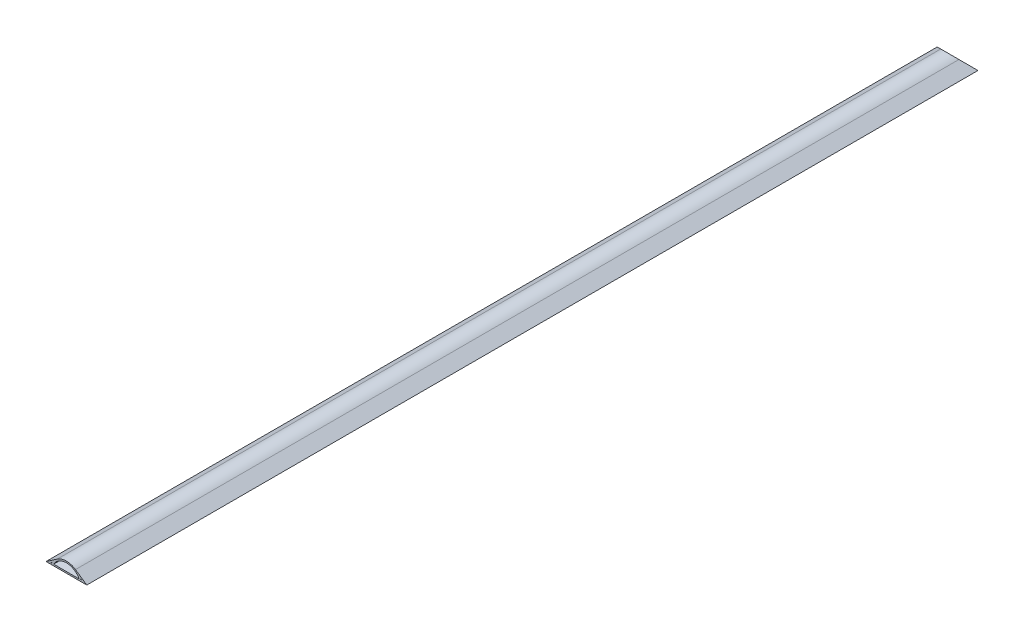
ISO-10303-21;
HEADER;
FILE_DESCRIPTION(('STEP AP214'),'2;1');
FILE_NAME('part.step','',(''),(''),'','','');
FILE_SCHEMA(('AUTOMOTIVE_DESIGN { 1 0 10303 214 1 1 1 1 }'));
ENDSEC;
DATA;
#1=APPLICATION_CONTEXT('core data for automotive mechanical design processes');
#2=APPLICATION_PROTOCOL_DEFINITION('international standard','automotive_design',2000,#1);
#3=PRODUCT_CONTEXT('',#1,'mechanical');
#4=PRODUCT('Part','Part','',(#3));
#5=PRODUCT_RELATED_PRODUCT_CATEGORY('part','',(#4));
#6=PRODUCT_DEFINITION_FORMATION('','',#4);
#7=PRODUCT_DEFINITION_CONTEXT('part definition',#1,'design');
#8=PRODUCT_DEFINITION('design','',#6,#7);
#9=PRODUCT_DEFINITION_SHAPE('','',#8);
#10=(LENGTH_UNIT() NAMED_UNIT(*) SI_UNIT(.MILLI.,.METRE.));
#11=(NAMED_UNIT(*) PLANE_ANGLE_UNIT() SI_UNIT($,.RADIAN.));
#12=(NAMED_UNIT(*) SI_UNIT($,.STERADIAN.) SOLID_ANGLE_UNIT());
#13=UNCERTAINTY_MEASURE_WITH_UNIT(LENGTH_MEASURE(1.E-05),#10,'distance_accuracy_value','');
#14=(GEOMETRIC_REPRESENTATION_CONTEXT(3) GLOBAL_UNCERTAINTY_ASSIGNED_CONTEXT((#13)) GLOBAL_UNIT_ASSIGNED_CONTEXT((#10,
#11,#12)) REPRESENTATION_CONTEXT('',''));
#15=CARTESIAN_POINT('',(0.,0.,0.));
#16=DIRECTION('',(0.,0.,1.));
#17=DIRECTION('',(1.,0.,0.));
#18=AXIS2_PLACEMENT_3D('',#15,#16,#17);
#19=CARTESIAN_POINT('',(34.29,-9.25285714285715,1498.6));
#20=DIRECTION('',(0.,0.,-1.));
#21=DIRECTION('',(-1.,0.,0.));
#22=AXIS2_PLACEMENT_3D('',#19,#20,#21);
#23=CYLINDRICAL_SURFACE('',#22,27.0328571428572);
#24=CARTESIAN_POINT('',(34.29,-9.25285714285715,-9.25285714285695));
#25=DIRECTION('',(0.,0.707106781186544,-0.707106781186551));
#26=DIRECTION('',(0.,-0.707106781186551,-0.707106781186544));
#27=AXIS2_PLACEMENT_3D('',#24,#25,#26);
#28=ELLIPSE('',#27,38.2302332011228,27.0328571428572);
#29=CARTESIAN_POINT('',(18.9926798567758,13.0354214300123,13.0354214300124));
#30=VERTEX_POINT('',#29);
#31=CARTESIAN_POINT('',(49.5873201432243,13.0354214300122,13.0354214300127));
#32=VERTEX_POINT('',#31);
#33=EDGE_CURVE('E48',#30,#32,#28,.T.);
#34=ORIENTED_EDGE('',*,*,#33,.F.);
#35=DIRECTION('',(0.,0.,-1.));
#36=VECTOR('',#35,1.);
#37=CARTESIAN_POINT('',(18.9926798567758,13.0354214300123,1498.6));
#38=LINE('',#37,#36);
#39=CARTESIAN_POINT('',(18.9926798567758,13.0354214300123,1498.6));
#40=VERTEX_POINT('',#39);
#41=EDGE_CURVE('E41',#40,#30,#38,.T.);
#42=ORIENTED_EDGE('',*,*,#41,.F.);
#43=CARTESIAN_POINT('',(34.29,-9.25285714285715,1498.6));
#44=DIRECTION('',(0.,0.,1.));
#45=DIRECTION('',(1.,0.,0.));
#46=AXIS2_PLACEMENT_3D('',#43,#44,#45);
#47=CIRCLE('',#46,27.0328571428572);
#48=CARTESIAN_POINT('',(49.5873201432242,13.0354214300123,1498.6));
#49=VERTEX_POINT('',#48);
#50=EDGE_CURVE('E139',#49,#40,#47,.T.);
#51=ORIENTED_EDGE('',*,*,#50,.F.);
#52=DIRECTION('',(0.,0.,-1.));
#53=VECTOR('',#52,1.);
#54=CARTESIAN_POINT('',(49.5873201432242,13.0354214300123,1498.6));
#55=LINE('',#54,#53);
#56=EDGE_CURVE('E144',#49,#32,#55,.T.);
#57=ORIENTED_EDGE('',*,*,#56,.T.);
#58=EDGE_LOOP('',(#34,#42,#51,#57));
#59=FACE_BOUND('',#58,.T.);
#60=ADVANCED_FACE('F34',(#59),#23,.T.);
#61=CARTESIAN_POINT('',(18.9926798567758,13.0354214300123,1498.6));
#62=DIRECTION('',(0.565878777163079,-0.824488453258394,0.));
#63=DIRECTION('',(0.824488453258394,0.565878777163079,0.));
#64=AXIS2_PLACEMENT_3D('',#61,#62,#63);
#65=PLANE('',#64);
#66=DIRECTION('',(0.717565620621447,0.492493441632557,0.492493441632552));
#67=VECTOR('',#66,1.);
#68=CARTESIAN_POINT('',(543.985797583654,373.358798069482,373.358798069479));
#69=LINE('',#68,#67);
#70=CARTESIAN_POINT('',(0.,0.,0.));
#71=VERTEX_POINT('',#70);
#72=EDGE_CURVE('E152',#71,#30,#69,.T.);
#73=ORIENTED_EDGE('',*,*,#72,.F.);
#74=DIRECTION('',(0.,0.,-1.));
#75=VECTOR('',#74,1.);
#76=CARTESIAN_POINT('',(0.,0.,1498.6));
#77=LINE('',#76,#75);
#78=CARTESIAN_POINT('',(0.,0.,1498.6));
#79=VERTEX_POINT('',#78);
#80=EDGE_CURVE('E138',#79,#71,#77,.T.);
#81=ORIENTED_EDGE('',*,*,#80,.F.);
#82=DIRECTION('',(-0.824488453258394,-0.565878777163079,0.));
#83=VECTOR('',#82,1.);
#84=CARTESIAN_POINT('',(18.9926798567758,13.0354214300123,1498.6));
#85=LINE('',#84,#83);
#86=EDGE_CURVE('E153',#40,#79,#85,.T.);
#87=ORIENTED_EDGE('',*,*,#86,.F.);
#88=ORIENTED_EDGE('',*,*,#41,.T.);
#89=EDGE_LOOP('',(#73,#81,#87,#88));
#90=FACE_BOUND('',#89,.T.);
#91=ADVANCED_FACE('F151',(#90),#65,.F.);
#92=CARTESIAN_POINT('',(49.5873201432242,13.0354214300123,1498.6));
#93=DIRECTION('',(-0.565878777163079,-0.824488453258394,0.));
#94=DIRECTION('',(0.824488453258394,-0.565878777163079,0.));
#95=AXIS2_PLACEMENT_3D('',#92,#93,#94);
#96=PLANE('',#95);
#97=DIRECTION('',(0.717565620621447,-0.492493441632557,-0.492493441632552));
#98=VECTOR('',#97,1.);
#99=CARTESIAN_POINT('',(-475.405797583654,373.358798069482,373.358798069479));
#100=LINE('',#99,#98);
#101=CARTESIAN_POINT('',(68.58,0.,0.));
#102=VERTEX_POINT('',#101);
#103=EDGE_CURVE('E119',#32,#102,#100,.T.);
#104=ORIENTED_EDGE('',*,*,#103,.F.);
#105=ORIENTED_EDGE('',*,*,#56,.F.);
#106=DIRECTION('',(-0.824488453258394,0.565878777163079,0.));
#107=VECTOR('',#106,1.);
#108=CARTESIAN_POINT('',(49.5873201432242,13.0354214300123,1498.6));
#109=LINE('',#108,#107);
#110=CARTESIAN_POINT('',(68.58,0.,1498.6));
#111=VERTEX_POINT('',#110);
#112=EDGE_CURVE('E143',#111,#49,#109,.T.);
#113=ORIENTED_EDGE('',*,*,#112,.F.);
#114=DIRECTION('',(0.,0.,-1.));
#115=VECTOR('',#114,1.);
#116=CARTESIAN_POINT('',(68.58,0.,1498.6));
#117=LINE('',#116,#115);
#118=EDGE_CURVE('E135',#111,#102,#117,.T.);
#119=ORIENTED_EDGE('',*,*,#118,.T.);
#120=EDGE_LOOP('',(#104,#105,#113,#119));
#121=FACE_BOUND('',#120,.T.);
#122=ADVANCED_FACE('F142',(#121),#96,.F.);
#123=CARTESIAN_POINT('',(8.18938765385225,2.54,1498.6));
#124=DIRECTION('',(0.,1.,0.));
#125=DIRECTION('',(-1.,0.,0.));
#126=AXIS2_PLACEMENT_3D('',#123,#124,#125);
#127=PLANE('',#126);
#128=DIRECTION('',(0.,0.,-1.));
#129=VECTOR('',#128,1.);
#130=CARTESIAN_POINT('',(9.9650357510173,2.54,1498.6));
#131=LINE('',#130,#129);
#132=CARTESIAN_POINT('',(9.9650357510173,2.54,1498.6));
#133=VERTEX_POINT('',#132);
#134=CARTESIAN_POINT('',(9.9650357510173,2.54,2.54000000000021));
#135=VERTEX_POINT('',#134);
#136=EDGE_CURVE('E140',#133,#135,#131,.T.);
#137=ORIENTED_EDGE('',*,*,#136,.T.);
#138=DIRECTION('',(-1.,0.,0.));
#139=VECTOR('',#138,1.);
#140=CARTESIAN_POINT('',(8.18938765385261,2.54,2.54000000000021));
#141=LINE('',#140,#139);
#142=CARTESIAN_POINT('',(8.18938765385224,2.53999999999993,2.53999999999993));
#143=VERTEX_POINT('',#142);
#144=EDGE_CURVE('E128',#135,#143,#141,.T.);
#145=ORIENTED_EDGE('',*,*,#144,.T.);
#146=DIRECTION('',(0.,0.,-1.));
#147=VECTOR('',#146,1.);
#148=CARTESIAN_POINT('',(8.18938765385225,2.54,1498.6));
#149=LINE('',#148,#147);
#150=CARTESIAN_POINT('',(8.18938765385225,2.54,1498.6));
#151=VERTEX_POINT('',#150);
#152=EDGE_CURVE('E195',#151,#143,#149,.T.);
#153=ORIENTED_EDGE('',*,*,#152,.F.);
#154=DIRECTION('',(1.,0.,0.));
#155=VECTOR('',#154,1.);
#156=CARTESIAN_POINT('',(8.18938765385225,2.54,1498.6));
#157=LINE('',#156,#155);
#158=EDGE_CURVE('E188',#151,#133,#157,.T.);
#159=ORIENTED_EDGE('',*,*,#158,.T.);
#160=EDGE_LOOP('',(#137,#145,#153,#159));
#161=FACE_BOUND('',#160,.T.);
#162=ADVANCED_FACE('F246',(#161),#127,.T.);
#163=CARTESIAN_POINT('',(34.29,-9.25285714285715,1498.6));
#164=DIRECTION('',(0.,0.,-1.));
#165=DIRECTION('',(-1.,0.,0.));
#166=AXIS2_PLACEMENT_3D('',#163,#164,#165);
#167=CYLINDRICAL_SURFACE('',#166,27.0328571428572);
#168=DIRECTION('',(0.,0.,-1.));
#169=VECTOR('',#168,1.);
#170=CARTESIAN_POINT('',(10.9978022708371,4.46752514961934,1498.6));
#171=LINE('',#170,#169);
#172=CARTESIAN_POINT('',(10.9978022708371,4.46752514961934,1498.6));
#173=VERTEX_POINT('',#172);
#174=CARTESIAN_POINT('',(10.9978022708371,4.46752514961929,4.46752514961918));
#175=VERTEX_POINT('',#174);
#176=EDGE_CURVE('E198',#173,#175,#171,.T.);
#177=ORIENTED_EDGE('',*,*,#176,.T.);
#178=CARTESIAN_POINT('',(34.29,-9.25285714285715,-9.25285714285695));
#179=DIRECTION('',(0.,0.707106781186544,-0.707106781186551));
#180=DIRECTION('',(0.,-0.707106781186551,-0.707106781186544));
#181=AXIS2_PLACEMENT_3D('',#178,#179,#180);
#182=ELLIPSE('',#181,38.2302332011228,27.0328571428572);
#183=EDGE_CURVE('E56',#175,#135,#182,.F.);
#184=ORIENTED_EDGE('',*,*,#183,.T.);
#185=ORIENTED_EDGE('',*,*,#136,.F.);
#186=CARTESIAN_POINT('',(34.29,-9.25285714285715,1498.6));
#187=DIRECTION('',(0.,0.,-1.));
#188=DIRECTION('',(1.,0.,0.));
#189=AXIS2_PLACEMENT_3D('',#186,#187,#188);
#190=CIRCLE('',#189,27.0328571428572);
#191=EDGE_CURVE('E190',#133,#173,#190,.T.);
#192=ORIENTED_EDGE('',*,*,#191,.T.);
#193=EDGE_LOOP('',(#177,#184,#185,#192));
#194=FACE_BOUND('',#193,.T.);
#195=ADVANCED_FACE('F251',(#194),#167,.T.);
#196=CARTESIAN_POINT('',(10.9978022708371,4.46752514961934,1498.6));
#197=DIRECTION('',(0.565878777163076,-0.824488453258395,0.));
#198=DIRECTION('',(0.824488453258396,0.565878777163077,0.));
#199=AXIS2_PLACEMENT_3D('',#196,#197,#198);
#200=PLANE('',#199);
#201=ORIENTED_EDGE('',*,*,#152,.T.);
#202=DIRECTION('',(0.717565620621449,0.492493441632556,0.492493441632551));
#203=VECTOR('',#202,1.);
#204=CARTESIAN_POINT('',(539.018783374031,366.869043233075,366.869043233072));
#205=LINE('',#204,#203);
#206=EDGE_CURVE('E241',#143,#175,#205,.T.);
#207=ORIENTED_EDGE('',*,*,#206,.T.);
#208=ORIENTED_EDGE('',*,*,#176,.F.);
#209=DIRECTION('',(-0.824488453258395,-0.565878777163076,0.));
#210=VECTOR('',#209,1.);
#211=CARTESIAN_POINT('',(10.9978022708371,4.46752514961934,1498.6));
#212=LINE('',#211,#210);
#213=EDGE_CURVE('E193',#173,#151,#212,.T.);
#214=ORIENTED_EDGE('',*,*,#213,.T.);
#215=EDGE_LOOP('',(#201,#207,#208,#214));
#216=FACE_BOUND('',#215,.T.);
#217=ADVANCED_FACE('F249',(#216),#200,.T.);
#218=CARTESIAN_POINT('',(58.6149642489827,2.54,1498.6));
#219=DIRECTION('',(0.,1.,0.));
#220=DIRECTION('',(-1.,0.,0.));
#221=AXIS2_PLACEMENT_3D('',#218,#219,#220);
#222=PLANE('',#221);
#223=DIRECTION('',(0.,0.,-1.));
#224=VECTOR('',#223,1.);
#225=CARTESIAN_POINT('',(60.3906123461478,2.54,1498.6));
#226=LINE('',#225,#224);
#227=CARTESIAN_POINT('',(60.3906123461478,2.54,1498.6));
#228=VERTEX_POINT('',#227);
#229=CARTESIAN_POINT('',(60.3906123461477,2.53999999999999,2.54000000000015));
#230=VERTEX_POINT('',#229);
#231=EDGE_CURVE('E185',#228,#230,#226,.T.);
#232=ORIENTED_EDGE('',*,*,#231,.T.);
#233=DIRECTION('',(-1.,0.,0.));
#234=VECTOR('',#233,1.);
#235=CARTESIAN_POINT('',(58.614964248982,2.54,2.54000000000021));
#236=LINE('',#235,#234);
#237=CARTESIAN_POINT('',(58.6149642489827,2.54,2.54000000000021));
#238=VERTEX_POINT('',#237);
#239=EDGE_CURVE('E238',#230,#238,#236,.T.);
#240=ORIENTED_EDGE('',*,*,#239,.T.);
#241=DIRECTION('',(0.,0.,-1.));
#242=VECTOR('',#241,1.);
#243=CARTESIAN_POINT('',(58.6149642489827,2.54,1498.6));
#244=LINE('',#243,#242);
#245=CARTESIAN_POINT('',(58.6149642489827,2.54,1498.6));
#246=VERTEX_POINT('',#245);
#247=EDGE_CURVE('E179',#246,#238,#244,.T.);
#248=ORIENTED_EDGE('',*,*,#247,.F.);
#249=DIRECTION('',(1.,0.,0.));
#250=VECTOR('',#249,1.);
#251=CARTESIAN_POINT('',(58.6149642489827,2.54,1498.6));
#252=LINE('',#251,#250);
#253=EDGE_CURVE('E172',#246,#228,#252,.T.);
#254=ORIENTED_EDGE('',*,*,#253,.T.);
#255=EDGE_LOOP('',(#232,#240,#248,#254));
#256=FACE_BOUND('',#255,.T.);
#257=ADVANCED_FACE('F258',(#256),#222,.T.);
#258=CARTESIAN_POINT('',(57.5821977291629,4.46752514961935,1498.6));
#259=DIRECTION('',(-0.565878777163076,-0.824488453258395,0.));
#260=DIRECTION('',(0.824488453258396,-0.565878777163076,0.));
#261=AXIS2_PLACEMENT_3D('',#258,#259,#260);
#262=PLANE('',#261);
#263=DIRECTION('',(0.,0.,-1.));
#264=VECTOR('',#263,1.);
#265=CARTESIAN_POINT('',(57.5821977291629,4.46752514961935,1498.6));
#266=LINE('',#265,#264);
#267=CARTESIAN_POINT('',(57.5821977291629,4.46752514961936,1498.6));
#268=VERTEX_POINT('',#267);
#269=CARTESIAN_POINT('',(57.5821977291629,4.46752514961935,4.46752514961934));
#270=VERTEX_POINT('',#269);
#271=EDGE_CURVE('E182',#268,#270,#266,.T.);
#272=ORIENTED_EDGE('',*,*,#271,.T.);
#273=DIRECTION('',(0.717565620621449,-0.492493441632556,-0.492493441632551));
#274=VECTOR('',#273,1.);
#275=CARTESIAN_POINT('',(-470.438783374031,366.869043233075,366.869043233072));
#276=LINE('',#275,#274);
#277=EDGE_CURVE('E233',#270,#230,#276,.T.);
#278=ORIENTED_EDGE('',*,*,#277,.T.);
#279=ORIENTED_EDGE('',*,*,#231,.F.);
#280=DIRECTION('',(-0.824488453258395,0.565878777163076,0.));
#281=VECTOR('',#280,1.);
#282=CARTESIAN_POINT('',(57.5821977291629,4.46752514961935,1498.6));
#283=LINE('',#282,#281);
#284=EDGE_CURVE('E174',#228,#268,#283,.T.);
#285=ORIENTED_EDGE('',*,*,#284,.T.);
#286=EDGE_LOOP('',(#272,#278,#279,#285));
#287=FACE_BOUND('',#286,.T.);
#288=ADVANCED_FACE('F286',(#287),#262,.T.);
#289=CARTESIAN_POINT('',(34.29,-9.25285714285715,1498.6));
#290=DIRECTION('',(0.,0.,-1.));
#291=DIRECTION('',(-1.,0.,0.));
#292=AXIS2_PLACEMENT_3D('',#289,#290,#291);
#293=CYLINDRICAL_SURFACE('',#292,27.0328571428572);
#294=ORIENTED_EDGE('',*,*,#247,.T.);
#295=CARTESIAN_POINT('',(34.29,-9.25285714285715,-9.25285714285695));
#296=DIRECTION('',(0.,0.707106781186544,-0.707106781186551));
#297=DIRECTION('',(0.,-0.707106781186551,-0.707106781186544));
#298=AXIS2_PLACEMENT_3D('',#295,#296,#297);
#299=ELLIPSE('',#298,38.2302332011228,27.0328571428572);
#300=EDGE_CURVE('E230',#238,#270,#299,.F.);
#301=ORIENTED_EDGE('',*,*,#300,.T.);
#302=ORIENTED_EDGE('',*,*,#271,.F.);
#303=CARTESIAN_POINT('',(34.29,-9.25285714285715,1498.6));
#304=DIRECTION('',(0.,0.,-1.));
#305=DIRECTION('',(1.,0.,0.));
#306=AXIS2_PLACEMENT_3D('',#303,#304,#305);
#307=CIRCLE('',#306,27.0328571428572);
#308=EDGE_CURVE('E177',#268,#246,#307,.T.);
#309=ORIENTED_EDGE('',*,*,#308,.T.);
#310=EDGE_LOOP('',(#294,#301,#302,#309));
#311=FACE_BOUND('',#310,.T.);
#312=ADVANCED_FACE('F283',(#311),#293,.T.);
#313=CARTESIAN_POINT('',(34.29,-9.25285714285715,1498.6));
#314=DIRECTION('',(0.,0.,-1.));
#315=DIRECTION('',(-1.,0.,0.));
#316=AXIS2_PLACEMENT_3D('',#313,#314,#315);
#317=CYLINDRICAL_SURFACE('',#316,24.4928571428572);
#318=DIRECTION('',(0.,0.,-1.));
#319=VECTOR('',#318,1.);
#320=CARTESIAN_POINT('',(12.8230819298957,2.54,1498.6));
#321=LINE('',#320,#319);
#322=CARTESIAN_POINT('',(12.8230819298957,2.54,1498.6));
#323=VERTEX_POINT('',#322);
#324=CARTESIAN_POINT('',(12.8230819298957,2.54,2.54000000000065));
#325=VERTEX_POINT('',#324);
#326=EDGE_CURVE('E169',#323,#325,#321,.T.);
#327=ORIENTED_EDGE('',*,*,#326,.T.);
#328=CARTESIAN_POINT('',(34.29,-9.25285714285715,-9.25285714285695));
#329=DIRECTION('',(0.,0.707106781186544,-0.707106781186551));
#330=DIRECTION('',(0.,-0.707106781186551,-0.707106781186544));
#331=AXIS2_PLACEMENT_3D('',#328,#329,#330);
#332=ELLIPSE('',#331,34.6381307526951,24.4928571428572);
#333=CARTESIAN_POINT('',(55.7569180701043,2.54,2.54000000000021));
#334=VERTEX_POINT('',#333);
#335=EDGE_CURVE('E228',#325,#334,#332,.T.);
#336=ORIENTED_EDGE('',*,*,#335,.T.);
#337=DIRECTION('',(0.,0.,-1.));
#338=VECTOR('',#337,1.);
#339=CARTESIAN_POINT('',(55.7569180701043,2.54,1498.6));
#340=LINE('',#339,#338);
#341=CARTESIAN_POINT('',(55.7569180701043,2.54,1498.6));
#342=VERTEX_POINT('',#341);
#343=EDGE_CURVE('E166',#342,#334,#340,.T.);
#344=ORIENTED_EDGE('',*,*,#343,.F.);
#345=CARTESIAN_POINT('',(34.29,-9.25285714285715,1498.6));
#346=DIRECTION('',(0.,0.,1.));
#347=DIRECTION('',(1.,0.,0.));
#348=AXIS2_PLACEMENT_3D('',#345,#346,#347);
#349=CIRCLE('',#348,24.4928571428572);
#350=EDGE_CURVE('E158',#342,#323,#349,.T.);
#351=ORIENTED_EDGE('',*,*,#350,.T.);
#352=EDGE_LOOP('',(#327,#336,#344,#351));
#353=FACE_BOUND('',#352,.T.);
#354=ADVANCED_FACE('F227',(#353),#317,.F.);
#355=CARTESIAN_POINT('',(12.8230819298957,2.54,1498.6));
#356=DIRECTION('',(0.,1.,0.));
#357=DIRECTION('',(0.,0.,1.));
#358=AXIS2_PLACEMENT_3D('',#355,#356,#357);
#359=PLANE('',#358);
#360=ORIENTED_EDGE('',*,*,#343,.T.);
#361=DIRECTION('',(-1.,0.,0.));
#362=VECTOR('',#361,1.);
#363=CARTESIAN_POINT('',(12.8230819298957,2.54,2.54000000000021));
#364=LINE('',#363,#362);
#365=EDGE_CURVE('E11',#334,#325,#364,.T.);
#366=ORIENTED_EDGE('',*,*,#365,.T.);
#367=ORIENTED_EDGE('',*,*,#326,.F.);
#368=DIRECTION('',(1.,0.,0.));
#369=VECTOR('',#368,1.);
#370=CARTESIAN_POINT('',(12.8230819298957,2.54,1498.6));
#371=LINE('',#370,#369);
#372=EDGE_CURVE('E164',#323,#342,#371,.T.);
#373=ORIENTED_EDGE('',*,*,#372,.T.);
#374=EDGE_LOOP('',(#360,#366,#367,#373));
#375=FACE_BOUND('',#374,.T.);
#376=ADVANCED_FACE('F211',(#375),#359,.T.);
#377=CARTESIAN_POINT('',(34.29,-9.25285714285715,1498.6));
#378=DIRECTION('',(0.,0.,1.));
#379=DIRECTION('',(1.,0.,0.));
#380=AXIS2_PLACEMENT_3D('',#377,#378,#379);
#381=PLANE('',#380);
#382=ORIENTED_EDGE('',*,*,#50,.T.);
#383=ORIENTED_EDGE('',*,*,#86,.T.);
#384=DIRECTION('',(1.,0.,0.));
#385=VECTOR('',#384,1.);
#386=CARTESIAN_POINT('',(0.,0.,1498.6));
#387=LINE('',#386,#385);
#388=EDGE_CURVE('E205',#79,#111,#387,.T.);
#389=ORIENTED_EDGE('',*,*,#388,.T.);
#390=ORIENTED_EDGE('',*,*,#112,.T.);
#391=EDGE_LOOP('',(#382,#383,#389,#390));
#392=FACE_BOUND('',#391,.T.);
#393=ORIENTED_EDGE('',*,*,#191,.F.);
#394=ORIENTED_EDGE('',*,*,#158,.F.);
#395=ORIENTED_EDGE('',*,*,#213,.F.);
#396=EDGE_LOOP('',(#393,#394,#395));
#397=FACE_BOUND('',#396,.T.);
#398=ORIENTED_EDGE('',*,*,#284,.F.);
#399=ORIENTED_EDGE('',*,*,#253,.F.);
#400=ORIENTED_EDGE('',*,*,#308,.F.);
#401=EDGE_LOOP('',(#398,#399,#400));
#402=FACE_BOUND('',#401,.T.);
#403=ORIENTED_EDGE('',*,*,#372,.F.);
#404=ORIENTED_EDGE('',*,*,#350,.F.);
#405=EDGE_LOOP('',(#403,#404));
#406=FACE_BOUND('',#405,.T.);
#407=ADVANCED_FACE('F208',(#392,#397,#402,#406),#381,.T.);
#408=CARTESIAN_POINT('',(0.,0.,1498.6));
#409=DIRECTION('',(0.,1.,0.));
#410=DIRECTION('',(0.,0.,1.));
#411=AXIS2_PLACEMENT_3D('',#408,#409,#410);
#412=PLANE('',#411);
#413=DIRECTION('',(1.,0.,0.));
#414=VECTOR('',#413,1.);
#415=CARTESIAN_POINT('',(0.,0.,0.));
#416=LINE('',#415,#414);
#417=EDGE_CURVE('E122',#71,#102,#416,.T.);
#418=ORIENTED_EDGE('',*,*,#417,.T.);
#419=ORIENTED_EDGE('',*,*,#118,.F.);
#420=ORIENTED_EDGE('',*,*,#388,.F.);
#421=ORIENTED_EDGE('',*,*,#80,.T.);
#422=EDGE_LOOP('',(#418,#419,#420,#421));
#423=FACE_BOUND('',#422,.T.);
#424=ADVANCED_FACE('F133',(#423),#412,.F.);
#425=CARTESIAN_POINT('',(68.58,17.78,17.7799999999998));
#426=DIRECTION('',(0.,0.707106781186544,-0.707106781186551));
#427=DIRECTION('',(0.,0.707106781186551,0.707106781186544));
#428=AXIS2_PLACEMENT_3D('',#425,#426,#427);
#429=PLANE('',#428);
#430=ORIENTED_EDGE('',*,*,#183,.F.);
#431=ORIENTED_EDGE('',*,*,#206,.F.);
#432=ORIENTED_EDGE('',*,*,#144,.F.);
#433=EDGE_LOOP('',(#430,#431,#432));
#434=FACE_BOUND('',#433,.T.);
#435=ORIENTED_EDGE('',*,*,#277,.F.);
#436=ORIENTED_EDGE('',*,*,#300,.F.);
#437=ORIENTED_EDGE('',*,*,#239,.F.);
#438=EDGE_LOOP('',(#435,#436,#437));
#439=FACE_BOUND('',#438,.T.);
#440=ORIENTED_EDGE('',*,*,#365,.F.);
#441=ORIENTED_EDGE('',*,*,#335,.F.);
#442=EDGE_LOOP('',(#440,#441));
#443=FACE_BOUND('',#442,.T.);
#444=ORIENTED_EDGE('',*,*,#72,.T.);
#445=ORIENTED_EDGE('',*,*,#33,.T.);
#446=ORIENTED_EDGE('',*,*,#103,.T.);
#447=ORIENTED_EDGE('',*,*,#417,.F.);
#448=EDGE_LOOP('',(#444,#445,#446,#447));
#449=FACE_BOUND('',#448,.T.);
#450=ADVANCED_FACE('F121',(#434,#439,#443,#449),#429,.T.);
#451=CLOSED_SHELL('',(#60,#91,#122,#162,#195,#217,#257,#288,#312,#354,#376,#407,#424,#450));
#452=MANIFOLD_SOLID_BREP('B2',#451);
#453=ADVANCED_BREP_SHAPE_REPRESENTATION('',(#18,#452),#14);
#454=SHAPE_DEFINITION_REPRESENTATION(#9,#453);
ENDSEC;
END-ISO-10303-21;
